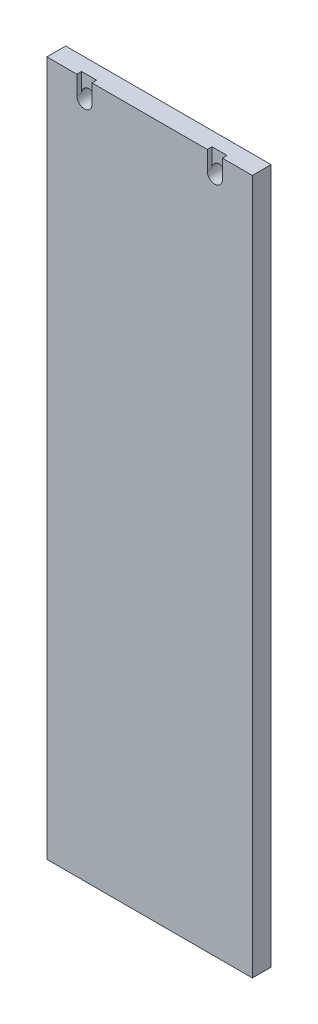
ISO-10303-21;
HEADER;
FILE_DESCRIPTION(('STEP AP214'),'2;1');
FILE_NAME('part.step','',(''),(''),'','','');
FILE_SCHEMA(('AUTOMOTIVE_DESIGN { 1 0 10303 214 1 1 1 1 }'));
ENDSEC;
DATA;
#1=APPLICATION_CONTEXT('core data for automotive mechanical design processes');
#2=APPLICATION_PROTOCOL_DEFINITION('international standard','automotive_design',2000,#1);
#3=PRODUCT_CONTEXT('',#1,'mechanical');
#4=PRODUCT('Part','Part','',(#3));
#5=PRODUCT_RELATED_PRODUCT_CATEGORY('part','',(#4));
#6=PRODUCT_DEFINITION_FORMATION('','',#4);
#7=PRODUCT_DEFINITION_CONTEXT('part definition',#1,'design');
#8=PRODUCT_DEFINITION('design','',#6,#7);
#9=PRODUCT_DEFINITION_SHAPE('','',#8);
#10=(LENGTH_UNIT() NAMED_UNIT(*) SI_UNIT(.MILLI.,.METRE.));
#11=(NAMED_UNIT(*) PLANE_ANGLE_UNIT() SI_UNIT($,.RADIAN.));
#12=(NAMED_UNIT(*) SI_UNIT($,.STERADIAN.) SOLID_ANGLE_UNIT());
#13=UNCERTAINTY_MEASURE_WITH_UNIT(LENGTH_MEASURE(1.E-05),#10,'distance_accuracy_value','');
#14=(GEOMETRIC_REPRESENTATION_CONTEXT(3) GLOBAL_UNCERTAINTY_ASSIGNED_CONTEXT((#13)) GLOBAL_UNIT_ASSIGNED_CONTEXT((#10,
#11,#12)) REPRESENTATION_CONTEXT('',''));
#15=CARTESIAN_POINT('',(0.,0.,0.));
#16=DIRECTION('',(0.,0.,1.));
#17=DIRECTION('',(1.,0.,0.));
#18=AXIS2_PLACEMENT_3D('',#15,#16,#17);
#19=CARTESIAN_POINT('',(0.,28.5749999999999,-6.35));
#20=DIRECTION('',(0.,1.,0.));
#21=DIRECTION('',(-1.,0.,0.));
#22=AXIS2_PLACEMENT_3D('',#19,#20,#21);
#23=PLANE('',#22);
#24=DIRECTION('',(-1.,0.,0.));
#25=VECTOR('',#24,1.);
#26=CARTESIAN_POINT('',(0.,28.5749999999999,0.));
#27=LINE('',#26,#25);
#28=CARTESIAN_POINT('',(54.2473000000098,28.5749999999999,0.));
#29=VERTEX_POINT('',#28);
#30=CARTESIAN_POINT('',(15.2527,28.5749999999999,0.));
#31=VERTEX_POINT('',#30);
#32=EDGE_CURVE('E153',#29,#31,#27,.T.);
#33=ORIENTED_EDGE('',*,*,#32,.F.);
#34=DIRECTION('',(0.,0.,1.));
#35=VECTOR('',#34,1.);
#36=CARTESIAN_POINT('',(54.2473000000098,28.5749999999999,-1.5875));
#37=LINE('',#36,#35);
#38=CARTESIAN_POINT('',(54.2473000000098,28.5749999999999,-1.5875));
#39=VERTEX_POINT('',#38);
#40=EDGE_CURVE('E136',#39,#29,#37,.T.);
#41=ORIENTED_EDGE('',*,*,#40,.F.);
#42=DIRECTION('',(1.,0.,0.));
#43=VECTOR('',#42,1.);
#44=CARTESIAN_POINT('',(59.3527000000098,28.5749999999999,-1.5875));
#45=LINE('',#44,#43);
#46=CARTESIAN_POINT('',(59.3527000000098,28.5749999999999,-1.5875));
#47=VERTEX_POINT('',#46);
#48=EDGE_CURVE('E139',#39,#47,#45,.T.);
#49=ORIENTED_EDGE('',*,*,#48,.T.);
#50=DIRECTION('',(0.,0.,1.));
#51=VECTOR('',#50,1.);
#52=CARTESIAN_POINT('',(59.3527000000098,28.5749999999999,-1.5875));
#53=LINE('',#52,#51);
#54=CARTESIAN_POINT('',(59.3527000000098,28.5749999999999,0.));
#55=VERTEX_POINT('',#54);
#56=EDGE_CURVE('E154',#47,#55,#53,.T.);
#57=ORIENTED_EDGE('',*,*,#56,.T.);
#58=CARTESIAN_POINT('',(69.5000000000098,28.5749999999999,0.));
#59=VERTEX_POINT('',#58);
#60=EDGE_CURVE('E199',#59,#55,#27,.T.);
#61=ORIENTED_EDGE('',*,*,#60,.F.);
#62=DIRECTION('',(0.,0.,1.));
#63=VECTOR('',#62,1.);
#64=CARTESIAN_POINT('',(69.5000000000098,28.5749999999999,-6.35));
#65=LINE('',#64,#63);
#66=CARTESIAN_POINT('',(69.5000000000098,28.5749999999999,-6.35));
#67=VERTEX_POINT('',#66);
#68=EDGE_CURVE('E222',#67,#59,#65,.T.);
#69=ORIENTED_EDGE('',*,*,#68,.F.);
#70=DIRECTION('',(-1.,0.,0.));
#71=VECTOR('',#70,1.);
#72=CARTESIAN_POINT('',(0.,28.5749999999999,-6.35));
#73=LINE('',#72,#71);
#74=CARTESIAN_POINT('',(0.,28.5749999999999,-6.35));
#75=VERTEX_POINT('',#74);
#76=EDGE_CURVE('E204',#67,#75,#73,.T.);
#77=ORIENTED_EDGE('',*,*,#76,.T.);
#78=DIRECTION('',(0.,0.,1.));
#79=VECTOR('',#78,1.);
#80=CARTESIAN_POINT('',(0.,28.5749999999999,-6.35));
#81=LINE('',#80,#79);
#82=CARTESIAN_POINT('',(0.,28.5749999999999,0.));
#83=VERTEX_POINT('',#82);
#84=EDGE_CURVE('E219',#75,#83,#81,.T.);
#85=ORIENTED_EDGE('',*,*,#84,.T.);
#86=CARTESIAN_POINT('',(10.1473,28.5749999999999,0.));
#87=VERTEX_POINT('',#86);
#88=EDGE_CURVE('E216',#87,#83,#27,.T.);
#89=ORIENTED_EDGE('',*,*,#88,.F.);
#90=DIRECTION('',(0.,0.,1.));
#91=VECTOR('',#90,1.);
#92=CARTESIAN_POINT('',(10.1473,28.5749999999999,-1.5875));
#93=LINE('',#92,#91);
#94=CARTESIAN_POINT('',(10.1473,28.5749999999999,-1.5875));
#95=VERTEX_POINT('',#94);
#96=EDGE_CURVE('E180',#95,#87,#93,.T.);
#97=ORIENTED_EDGE('',*,*,#96,.F.);
#98=DIRECTION('',(1.,0.,0.));
#99=VECTOR('',#98,1.);
#100=CARTESIAN_POINT('',(10.1473,28.5749999999999,-1.5875));
#101=LINE('',#100,#99);
#102=CARTESIAN_POINT('',(15.2527,28.5749999999999,-1.5875));
#103=VERTEX_POINT('',#102);
#104=EDGE_CURVE('E164',#95,#103,#101,.T.);
#105=ORIENTED_EDGE('',*,*,#104,.T.);
#106=DIRECTION('',(0.,0.,1.));
#107=VECTOR('',#106,1.);
#108=CARTESIAN_POINT('',(15.2527,28.5749999999999,-1.5875));
#109=LINE('',#108,#107);
#110=EDGE_CURVE('E178',#103,#31,#109,.T.);
#111=ORIENTED_EDGE('',*,*,#110,.T.);
#112=EDGE_LOOP('',(#33,#41,#49,#57,#61,#69,#77,#85,#89,#97,#105,#111));
#113=FACE_BOUND('',#112,.T.);
#114=ADVANCED_FACE('F46',(#113),#23,.T.);
#115=CARTESIAN_POINT('',(0.,0.,0.));
#116=DIRECTION('',(0.,0.,-1.));
#117=DIRECTION('',(-1.,0.,0.));
#118=AXIS2_PLACEMENT_3D('',#115,#116,#117);
#119=PLANE('',#118);
#120=DIRECTION('',(0.,1.,0.));
#121=VECTOR('',#120,1.);
#122=CARTESIAN_POINT('',(54.2473000000098,28.5749999999999,0.));
#123=LINE('',#122,#121);
#124=CARTESIAN_POINT('',(54.2473000000098,22.2249999999999,0.));
#125=VERTEX_POINT('',#124);
#126=EDGE_CURVE('E183',#125,#29,#123,.T.);
#127=ORIENTED_EDGE('',*,*,#126,.T.);
#128=ORIENTED_EDGE('',*,*,#32,.T.);
#129=DIRECTION('',(0.,-1.,0.));
#130=VECTOR('',#129,1.);
#131=CARTESIAN_POINT('',(15.2527,28.5749999999999,0.));
#132=LINE('',#131,#130);
#133=CARTESIAN_POINT('',(15.2527,22.2249999999999,0.));
#134=VERTEX_POINT('',#133);
#135=EDGE_CURVE('E165',#31,#134,#132,.T.);
#136=ORIENTED_EDGE('',*,*,#135,.T.);
#137=CARTESIAN_POINT('',(12.7,22.2249999999999,0.));
#138=DIRECTION('',(0.,0.,1.));
#139=DIRECTION('',(1.,0.,0.));
#140=AXIS2_PLACEMENT_3D('',#137,#138,#139);
#141=CIRCLE('',#140,2.5527);
#142=CARTESIAN_POINT('',(10.1473,22.2249999999999,0.));
#143=VERTEX_POINT('',#142);
#144=EDGE_CURVE('E156',#143,#134,#141,.T.);
#145=ORIENTED_EDGE('',*,*,#144,.F.);
#146=DIRECTION('',(0.,1.,0.));
#147=VECTOR('',#146,1.);
#148=CARTESIAN_POINT('',(10.1473,22.2249999999999,0.));
#149=LINE('',#148,#147);
#150=EDGE_CURVE('E172',#143,#87,#149,.T.);
#151=ORIENTED_EDGE('',*,*,#150,.T.);
#152=ORIENTED_EDGE('',*,*,#88,.T.);
#153=DIRECTION('',(0.,-1.,0.));
#154=VECTOR('',#153,1.);
#155=CARTESIAN_POINT('',(0.,15.8749999999999,0.));
#156=LINE('',#155,#154);
#157=CARTESIAN_POINT('',(0.,-206.525,0.));
#158=VERTEX_POINT('',#157);
#159=EDGE_CURVE('E195',#83,#158,#156,.T.);
#160=ORIENTED_EDGE('',*,*,#159,.T.);
#161=DIRECTION('',(1.,0.,0.));
#162=VECTOR('',#161,1.);
#163=CARTESIAN_POINT('',(0.,-206.525,0.));
#164=LINE('',#163,#162);
#165=CARTESIAN_POINT('',(69.5000000000098,-206.525,0.));
#166=VERTEX_POINT('',#165);
#167=EDGE_CURVE('E210',#158,#166,#164,.T.);
#168=ORIENTED_EDGE('',*,*,#167,.T.);
#169=DIRECTION('',(0.,1.,0.));
#170=VECTOR('',#169,1.);
#171=CARTESIAN_POINT('',(69.5000000000098,28.5749999999999,0.));
#172=LINE('',#171,#170);
#173=EDGE_CURVE('E213',#166,#59,#172,.T.);
#174=ORIENTED_EDGE('',*,*,#173,.T.);
#175=ORIENTED_EDGE('',*,*,#60,.T.);
#176=DIRECTION('',(0.,-1.,0.));
#177=VECTOR('',#176,1.);
#178=CARTESIAN_POINT('',(59.3527000000098,22.2249999999999,0.));
#179=LINE('',#178,#177);
#180=CARTESIAN_POINT('',(59.3527000000098,22.2249999999999,0.));
#181=VERTEX_POINT('',#180);
#182=EDGE_CURVE('E140',#55,#181,#179,.T.);
#183=ORIENTED_EDGE('',*,*,#182,.T.);
#184=CARTESIAN_POINT('',(56.8000000000098,22.2249999999999,0.));
#185=DIRECTION('',(0.,0.,1.));
#186=DIRECTION('',(1.,0.,0.));
#187=AXIS2_PLACEMENT_3D('',#184,#185,#186);
#188=CIRCLE('',#187,2.5527);
#189=EDGE_CURVE('E189',#125,#181,#188,.T.);
#190=ORIENTED_EDGE('',*,*,#189,.F.);
#191=EDGE_LOOP('',(#127,#128,#136,#145,#151,#152,#160,#168,#174,#175,#183,#190));
#192=FACE_BOUND('',#191,.T.);
#193=ADVANCED_FACE('F239',(#192),#119,.F.);
#194=CARTESIAN_POINT('',(12.7,22.2249999999999,0.));
#195=DIRECTION('',(0.,0.,1.));
#196=DIRECTION('',(1.,0.,0.));
#197=AXIS2_PLACEMENT_3D('',#194,#195,#196);
#198=CYLINDRICAL_SURFACE('',#197,2.5527);
#199=CARTESIAN_POINT('',(12.7,22.2249999999999,-6.35));
#200=DIRECTION('',(0.,0.,1.));
#201=DIRECTION('',(1.,0.,0.));
#202=AXIS2_PLACEMENT_3D('',#199,#200,#201);
#203=CIRCLE('',#202,2.5527);
#204=CARTESIAN_POINT('',(15.2527,22.2249999999999,-6.35));
#205=VERTEX_POINT('',#204);
#206=EDGE_CURVE('E186',#205,#205,#203,.T.);
#207=ORIENTED_EDGE('',*,*,#206,.F.);
#208=EDGE_LOOP('',(#207));
#209=FACE_BOUND('',#208,.T.);
#210=CARTESIAN_POINT('',(12.7,22.2249999999999,-1.5875));
#211=DIRECTION('',(0.,0.,1.));
#212=DIRECTION('',(1.,0.,0.));
#213=AXIS2_PLACEMENT_3D('',#210,#211,#212);
#214=CIRCLE('',#213,2.5527);
#215=CARTESIAN_POINT('',(10.1473,22.2249999999999,-1.5875));
#216=VERTEX_POINT('',#215);
#217=CARTESIAN_POINT('',(15.2527,22.2249999999999,-1.5875));
#218=VERTEX_POINT('',#217);
#219=EDGE_CURVE('E54',#216,#218,#214,.F.);
#220=ORIENTED_EDGE('',*,*,#219,.F.);
#221=DIRECTION('',(0.,0.,1.));
#222=VECTOR('',#221,1.);
#223=CARTESIAN_POINT('',(10.1473,22.2249999999999,-1.5875));
#224=LINE('',#223,#222);
#225=EDGE_CURVE('E69',#216,#143,#224,.T.);
#226=ORIENTED_EDGE('',*,*,#225,.T.);
#227=ORIENTED_EDGE('',*,*,#144,.T.);
#228=DIRECTION('',(0.,0.,1.));
#229=VECTOR('',#228,1.);
#230=CARTESIAN_POINT('',(15.2527,22.2249999999999,-1.5875));
#231=LINE('',#230,#229);
#232=EDGE_CURVE('E171',#218,#134,#231,.T.);
#233=ORIENTED_EDGE('',*,*,#232,.F.);
#234=EDGE_LOOP('',(#220,#226,#227,#233));
#235=FACE_BOUND('',#234,.T.);
#236=ADVANCED_FACE('F236',(#209,#235),#198,.F.);
#237=CARTESIAN_POINT('',(69.5000000000098,28.5749999999999,-6.35));
#238=DIRECTION('',(1.,0.,0.));
#239=DIRECTION('',(0.,0.,-1.));
#240=AXIS2_PLACEMENT_3D('',#237,#238,#239);
#241=PLANE('',#240);
#242=ORIENTED_EDGE('',*,*,#173,.F.);
#243=DIRECTION('',(0.,0.,1.));
#244=VECTOR('',#243,1.);
#245=CARTESIAN_POINT('',(69.5000000000098,-206.525,-6.35));
#246=LINE('',#245,#244);
#247=CARTESIAN_POINT('',(69.5000000000098,-206.525,-6.35));
#248=VERTEX_POINT('',#247);
#249=EDGE_CURVE('E224',#248,#166,#246,.T.);
#250=ORIENTED_EDGE('',*,*,#249,.F.);
#251=DIRECTION('',(0.,1.,0.));
#252=VECTOR('',#251,1.);
#253=CARTESIAN_POINT('',(69.5000000000098,15.8749999999999,-6.35));
#254=LINE('',#253,#252);
#255=EDGE_CURVE('E202',#248,#67,#254,.T.);
#256=ORIENTED_EDGE('',*,*,#255,.T.);
#257=ORIENTED_EDGE('',*,*,#68,.T.);
#258=EDGE_LOOP('',(#242,#250,#256,#257));
#259=FACE_BOUND('',#258,.T.);
#260=ADVANCED_FACE('F261',(#259),#241,.T.);
#261=CARTESIAN_POINT('',(0.,-206.525,-6.35));
#262=DIRECTION('',(0.,-1.,0.));
#263=DIRECTION('',(0.,0.,-1.));
#264=AXIS2_PLACEMENT_3D('',#261,#262,#263);
#265=PLANE('',#264);
#266=ORIENTED_EDGE('',*,*,#167,.F.);
#267=DIRECTION('',(0.,0.,1.));
#268=VECTOR('',#267,1.);
#269=CARTESIAN_POINT('',(0.,-206.525,-6.35));
#270=LINE('',#269,#268);
#271=CARTESIAN_POINT('',(0.,-206.525,-6.35));
#272=VERTEX_POINT('',#271);
#273=EDGE_CURVE('E207',#272,#158,#270,.T.);
#274=ORIENTED_EDGE('',*,*,#273,.F.);
#275=DIRECTION('',(1.,0.,0.));
#276=VECTOR('',#275,1.);
#277=CARTESIAN_POINT('',(0.,-206.525,-6.35));
#278=LINE('',#277,#276);
#279=EDGE_CURVE('E198',#272,#248,#278,.T.);
#280=ORIENTED_EDGE('',*,*,#279,.T.);
#281=ORIENTED_EDGE('',*,*,#249,.T.);
#282=EDGE_LOOP('',(#266,#274,#280,#281));
#283=FACE_BOUND('',#282,.T.);
#284=ADVANCED_FACE('F263',(#283),#265,.T.);
#285=CARTESIAN_POINT('',(0.,15.8749999999999,-6.35));
#286=DIRECTION('',(-1.,0.,0.));
#287=DIRECTION('',(0.,-1.,0.));
#288=AXIS2_PLACEMENT_3D('',#285,#286,#287);
#289=PLANE('',#288);
#290=ORIENTED_EDGE('',*,*,#159,.F.);
#291=ORIENTED_EDGE('',*,*,#84,.F.);
#292=DIRECTION('',(0.,-1.,0.));
#293=VECTOR('',#292,1.);
#294=CARTESIAN_POINT('',(0.,15.8749999999999,-6.35));
#295=LINE('',#294,#293);
#296=EDGE_CURVE('E196',#75,#272,#295,.T.);
#297=ORIENTED_EDGE('',*,*,#296,.T.);
#298=ORIENTED_EDGE('',*,*,#273,.T.);
#299=EDGE_LOOP('',(#290,#291,#297,#298));
#300=FACE_BOUND('',#299,.T.);
#301=ADVANCED_FACE('F48',(#300),#289,.T.);
#302=CARTESIAN_POINT('',(0.,0.,-6.35));
#303=DIRECTION('',(0.,0.,-1.));
#304=DIRECTION('',(-1.,0.,0.));
#305=AXIS2_PLACEMENT_3D('',#302,#303,#304);
#306=PLANE('',#305);
#307=ORIENTED_EDGE('',*,*,#206,.T.);
#308=EDGE_LOOP('',(#307));
#309=FACE_BOUND('',#308,.T.);
#310=CARTESIAN_POINT('',(56.8000000000098,22.2249999999999,-6.35));
#311=DIRECTION('',(0.,0.,1.));
#312=DIRECTION('',(1.,0.,0.));
#313=AXIS2_PLACEMENT_3D('',#310,#311,#312);
#314=CIRCLE('',#313,2.5527);
#315=CARTESIAN_POINT('',(59.3527000000098,22.2249999999999,-6.35));
#316=VERTEX_POINT('',#315);
#317=EDGE_CURVE('E192',#316,#316,#314,.T.);
#318=ORIENTED_EDGE('',*,*,#317,.T.);
#319=EDGE_LOOP('',(#318));
#320=FACE_BOUND('',#319,.T.);
#321=ORIENTED_EDGE('',*,*,#296,.F.);
#322=ORIENTED_EDGE('',*,*,#76,.F.);
#323=ORIENTED_EDGE('',*,*,#255,.F.);
#324=ORIENTED_EDGE('',*,*,#279,.F.);
#325=EDGE_LOOP('',(#321,#322,#323,#324));
#326=FACE_BOUND('',#325,.T.);
#327=ADVANCED_FACE('F270',(#309,#320,#326),#306,.T.);
#328=CARTESIAN_POINT('',(56.8000000000098,22.2249999999999,0.));
#329=DIRECTION('',(0.,0.,1.));
#330=DIRECTION('',(1.,0.,0.));
#331=AXIS2_PLACEMENT_3D('',#328,#329,#330);
#332=CYLINDRICAL_SURFACE('',#331,2.5527);
#333=CARTESIAN_POINT('',(56.8000000000098,22.2249999999999,-1.5875));
#334=DIRECTION('',(0.,0.,-1.));
#335=DIRECTION('',(-1.,0.,0.));
#336=AXIS2_PLACEMENT_3D('',#333,#334,#335);
#337=CIRCLE('',#336,2.5527);
#338=CARTESIAN_POINT('',(59.3527000000098,22.2249999999999,-1.5875));
#339=VERTEX_POINT('',#338);
#340=CARTESIAN_POINT('',(54.2473000000098,22.2249999999999,-1.5875));
#341=VERTEX_POINT('',#340);
#342=EDGE_CURVE('E13',#339,#341,#337,.F.);
#343=ORIENTED_EDGE('',*,*,#342,.T.);
#344=DIRECTION('',(0.,0.,1.));
#345=VECTOR('',#344,1.);
#346=CARTESIAN_POINT('',(54.2473000000098,22.2249999999999,-1.5875));
#347=LINE('',#346,#345);
#348=EDGE_CURVE('E61',#341,#125,#347,.T.);
#349=ORIENTED_EDGE('',*,*,#348,.T.);
#350=ORIENTED_EDGE('',*,*,#189,.T.);
#351=DIRECTION('',(0.,0.,1.));
#352=VECTOR('',#351,1.);
#353=CARTESIAN_POINT('',(59.3527000000098,22.2249999999999,-1.5875));
#354=LINE('',#353,#352);
#355=EDGE_CURVE('E158',#339,#181,#354,.T.);
#356=ORIENTED_EDGE('',*,*,#355,.F.);
#357=EDGE_LOOP('',(#343,#349,#350,#356));
#358=FACE_BOUND('',#357,.T.);
#359=ORIENTED_EDGE('',*,*,#317,.F.);
#360=EDGE_LOOP('',(#359));
#361=FACE_BOUND('',#360,.T.);
#362=ADVANCED_FACE('F250',(#358,#361),#332,.F.);
#363=CARTESIAN_POINT('',(12.7,22.2249999999999,-1.5875));
#364=DIRECTION('',(0.,0.,1.));
#365=DIRECTION('',(1.,0.,0.));
#366=AXIS2_PLACEMENT_3D('',#363,#364,#365);
#367=PLANE('',#366);
#368=ORIENTED_EDGE('',*,*,#219,.T.);
#369=DIRECTION('',(0.,-1.,0.));
#370=VECTOR('',#369,1.);
#371=CARTESIAN_POINT('',(15.2527,28.5749999999999,-1.5875));
#372=LINE('',#371,#370);
#373=EDGE_CURVE('E168',#103,#218,#372,.T.);
#374=ORIENTED_EDGE('',*,*,#373,.F.);
#375=ORIENTED_EDGE('',*,*,#104,.F.);
#376=DIRECTION('',(0.,1.,0.));
#377=VECTOR('',#376,1.);
#378=CARTESIAN_POINT('',(10.1473,22.2249999999999,-1.5875));
#379=LINE('',#378,#377);
#380=EDGE_CURVE('E162',#216,#95,#379,.T.);
#381=ORIENTED_EDGE('',*,*,#380,.F.);
#382=EDGE_LOOP('',(#368,#374,#375,#381));
#383=FACE_BOUND('',#382,.T.);
#384=ADVANCED_FACE('F230',(#383),#367,.T.);
#385=CARTESIAN_POINT('',(10.1473,22.2249999999999,-1.5875));
#386=DIRECTION('',(1.,0.,0.));
#387=DIRECTION('',(0.,0.,-1.));
#388=AXIS2_PLACEMENT_3D('',#385,#386,#387);
#389=PLANE('',#388);
#390=ORIENTED_EDGE('',*,*,#150,.F.);
#391=ORIENTED_EDGE('',*,*,#225,.F.);
#392=ORIENTED_EDGE('',*,*,#380,.T.);
#393=ORIENTED_EDGE('',*,*,#96,.T.);
#394=EDGE_LOOP('',(#390,#391,#392,#393));
#395=FACE_BOUND('',#394,.T.);
#396=ADVANCED_FACE('F242',(#395),#389,.T.);
#397=CARTESIAN_POINT('',(15.2527,28.5749999999999,-1.5875));
#398=DIRECTION('',(-1.,0.,0.));
#399=DIRECTION('',(0.,0.,1.));
#400=AXIS2_PLACEMENT_3D('',#397,#398,#399);
#401=PLANE('',#400);
#402=ORIENTED_EDGE('',*,*,#135,.F.);
#403=ORIENTED_EDGE('',*,*,#110,.F.);
#404=ORIENTED_EDGE('',*,*,#373,.T.);
#405=ORIENTED_EDGE('',*,*,#232,.T.);
#406=EDGE_LOOP('',(#402,#403,#404,#405));
#407=FACE_BOUND('',#406,.T.);
#408=ADVANCED_FACE('F235',(#407),#401,.T.);
#409=CARTESIAN_POINT('',(56.8000000000098,22.2249999999999,-1.5875));
#410=DIRECTION('',(0.,0.,-1.));
#411=DIRECTION('',(-1.,0.,0.));
#412=AXIS2_PLACEMENT_3D('',#409,#410,#411);
#413=PLANE('',#412);
#414=DIRECTION('',(0.,-1.,0.));
#415=VECTOR('',#414,1.);
#416=CARTESIAN_POINT('',(59.3527000000098,22.2249999999999,-1.5875));
#417=LINE('',#416,#415);
#418=EDGE_CURVE('E146',#47,#339,#417,.T.);
#419=ORIENTED_EDGE('',*,*,#418,.F.);
#420=ORIENTED_EDGE('',*,*,#48,.F.);
#421=DIRECTION('',(0.,1.,0.));
#422=VECTOR('',#421,1.);
#423=CARTESIAN_POINT('',(54.2473000000098,28.5749999999999,-1.5875));
#424=LINE('',#423,#422);
#425=EDGE_CURVE('E132',#341,#39,#424,.T.);
#426=ORIENTED_EDGE('',*,*,#425,.F.);
#427=ORIENTED_EDGE('',*,*,#342,.F.);
#428=EDGE_LOOP('',(#419,#420,#426,#427));
#429=FACE_BOUND('',#428,.T.);
#430=ADVANCED_FACE('F144',(#429),#413,.F.);
#431=CARTESIAN_POINT('',(54.2473000000098,28.5749999999999,-1.5875));
#432=DIRECTION('',(1.,0.,0.));
#433=DIRECTION('',(0.,1.,0.));
#434=AXIS2_PLACEMENT_3D('',#431,#432,#433);
#435=PLANE('',#434);
#436=ORIENTED_EDGE('',*,*,#126,.F.);
#437=ORIENTED_EDGE('',*,*,#348,.F.);
#438=ORIENTED_EDGE('',*,*,#425,.T.);
#439=ORIENTED_EDGE('',*,*,#40,.T.);
#440=EDGE_LOOP('',(#436,#437,#438,#439));
#441=FACE_BOUND('',#440,.T.);
#442=ADVANCED_FACE('F134',(#441),#435,.T.);
#443=CARTESIAN_POINT('',(59.3527000000098,22.2249999999999,-1.5875));
#444=DIRECTION('',(-1.,0.,0.));
#445=DIRECTION('',(0.,-1.,0.));
#446=AXIS2_PLACEMENT_3D('',#443,#444,#445);
#447=PLANE('',#446);
#448=ORIENTED_EDGE('',*,*,#182,.F.);
#449=ORIENTED_EDGE('',*,*,#56,.F.);
#450=ORIENTED_EDGE('',*,*,#418,.T.);
#451=ORIENTED_EDGE('',*,*,#355,.T.);
#452=EDGE_LOOP('',(#448,#449,#450,#451));
#453=FACE_BOUND('',#452,.T.);
#454=ADVANCED_FACE('F284',(#453),#447,.T.);
#455=CLOSED_SHELL('',(#114,#193,#236,#260,#284,#301,#327,#362,#384,#396,#408,#430,#442,#454));
#456=MANIFOLD_SOLID_BREP('B2',#455);
#457=ADVANCED_BREP_SHAPE_REPRESENTATION('',(#18,#456),#14);
#458=SHAPE_DEFINITION_REPRESENTATION(#9,#457);
ENDSEC;
END-ISO-10303-21;
